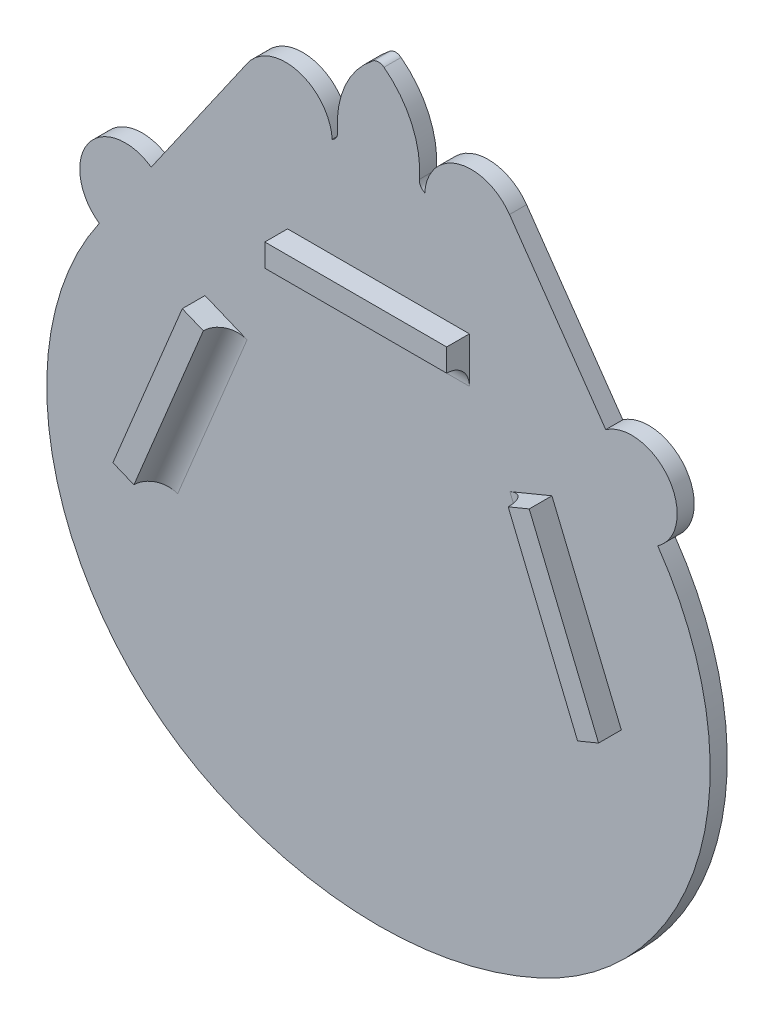
ISO-10303-21;
HEADER;
FILE_DESCRIPTION(('STEP AP214'),'2;1');
FILE_NAME('part.step','',(''),(''),'','','');
FILE_SCHEMA(('AUTOMOTIVE_DESIGN { 1 0 10303 214 1 1 1 1 }'));
ENDSEC;
DATA;
#1=APPLICATION_CONTEXT('core data for automotive mechanical design processes');
#2=APPLICATION_PROTOCOL_DEFINITION('international standard','automotive_design',2000,#1);
#3=PRODUCT_CONTEXT('',#1,'mechanical');
#4=PRODUCT('Part','Part','',(#3));
#5=PRODUCT_RELATED_PRODUCT_CATEGORY('part','',(#4));
#6=PRODUCT_DEFINITION_FORMATION('','',#4);
#7=PRODUCT_DEFINITION_CONTEXT('part definition',#1,'design');
#8=PRODUCT_DEFINITION('design','',#6,#7);
#9=PRODUCT_DEFINITION_SHAPE('','',#8);
#10=(LENGTH_UNIT() NAMED_UNIT(*) SI_UNIT(.MILLI.,.METRE.));
#11=(NAMED_UNIT(*) PLANE_ANGLE_UNIT() SI_UNIT($,.RADIAN.));
#12=(NAMED_UNIT(*) SI_UNIT($,.STERADIAN.) SOLID_ANGLE_UNIT());
#13=UNCERTAINTY_MEASURE_WITH_UNIT(LENGTH_MEASURE(1.E-05),#10,'distance_accuracy_value','');
#14=(GEOMETRIC_REPRESENTATION_CONTEXT(3) GLOBAL_UNCERTAINTY_ASSIGNED_CONTEXT((#13)) GLOBAL_UNIT_ASSIGNED_CONTEXT((#10,
#11,#12)) REPRESENTATION_CONTEXT('',''));
#15=CARTESIAN_POINT('',(0.,0.,0.));
#16=DIRECTION('',(0.,0.,1.));
#17=DIRECTION('',(1.,0.,0.));
#18=AXIS2_PLACEMENT_3D('',#15,#16,#17);
#19=CARTESIAN_POINT('',(-13.8853702908805,188.281326043095,4.7625));
#20=DIRECTION('',(0.,0.,1.));
#21=DIRECTION('',(1.,0.,0.));
#22=AXIS2_PLACEMENT_3D('',#19,#20,#21);
#23=PLANE('',#22);
#24=CARTESIAN_POINT('',(-13.8853702908805,188.281326043095,4.7625));
#25=DIRECTION('',(0.,0.,1.));
#26=DIRECTION('',(1.,0.,0.));
#27=AXIS2_PLACEMENT_3D('',#24,#25,#26);
#28=CIRCLE('',#27,25.4);
#29=CARTESIAN_POINT('',(11.436803074374,186.294485319737,4.7625));
#30=VERTEX_POINT('',#29);
#31=CARTESIAN_POINT('',(1.54281892120893,208.458812943994,4.7625));
#32=VERTEX_POINT('',#31);
#33=EDGE_CURVE('E284',#30,#32,#28,.T.);
#34=ORIENTED_EDGE('',*,*,#33,.T.);
#35=CARTESIAN_POINT('',(0.,206.441064253904,4.7625));
#36=DIRECTION('',(0.,0.,1.));
#37=DIRECTION('',(1.,0.,0.));
#38=AXIS2_PLACEMENT_3D('',#35,#36,#37);
#39=CIRCLE('',#38,2.54);
#40=CARTESIAN_POINT('',(-1.54281892120893,208.458812943994,4.7625));
#41=VERTEX_POINT('',#40);
#42=EDGE_CURVE('E379',#32,#41,#39,.T.);
#43=ORIENTED_EDGE('',*,*,#42,.T.);
#44=CARTESIAN_POINT('',(13.8853702908805,188.281326043095,4.7625));
#45=DIRECTION('',(0.,0.,-1.));
#46=DIRECTION('',(-1.,0.,0.));
#47=AXIS2_PLACEMENT_3D('',#44,#45,#46);
#48=CIRCLE('',#47,25.4);
#49=CARTESIAN_POINT('',(-11.436803074374,186.294485319737,4.7625));
#50=VERTEX_POINT('',#49);
#51=EDGE_CURVE('E287',#50,#41,#48,.T.);
#52=ORIENTED_EDGE('',*,*,#51,.F.);
#53=CARTESIAN_POINT('',(-13.9690204108995,186.095801247401,4.7625));
#54=DIRECTION('',(0.,0.,1.));
#55=DIRECTION('',(1.,0.,0.));
#56=AXIS2_PLACEMENT_3D('',#53,#54,#55);
#57=CIRCLE('',#56,2.54);
#58=CARTESIAN_POINT('',(-12.9267506258527,183.779495202169,4.7625));
#59=VERTEX_POINT('',#58);
#60=EDGE_CURVE('E387',#50,#59,#57,.F.);
#61=ORIENTED_EDGE('',*,*,#60,.T.);
#62=CARTESIAN_POINT('',(-25.9256059059936,182.927947731056,4.7625));
#63=DIRECTION('',(0.,0.,-1.));
#64=DIRECTION('',(-1.,0.,0.));
#65=AXIS2_PLACEMENT_3D('',#62,#63,#64);
#66=CIRCLE('',#65,13.0267176099586);
#67=CARTESIAN_POINT('',(-36.6160052473032,190.371786365318,4.7625));
#68=VERTEX_POINT('',#67);
#69=EDGE_CURVE('E291',#68,#59,#66,.T.);
#70=ORIENTED_EDGE('',*,*,#69,.F.);
#71=DIRECTION('',(0.571428571428567,0.820651806648293,0.));
#72=VECTOR('',#71,1.);
#73=CARTESIAN_POINT('',(-38.1,188.240561159318,4.7625));
#74=LINE('',#73,#72);
#75=CARTESIAN_POINT('',(-63.5,151.762588353802,4.7625));
#76=VERTEX_POINT('',#75);
#77=EDGE_CURVE('E294',#76,#68,#74,.T.);
#78=ORIENTED_EDGE('',*,*,#77,.F.);
#79=CARTESIAN_POINT('',(-70.7571428571429,141.340310409368,4.7625));
#80=DIRECTION('',(0.,0.,-1.));
#81=DIRECTION('',(-1.,0.,0.));
#82=AXIS2_PLACEMENT_3D('',#79,#80,#81);
#83=CIRCLE('',#82,12.7);
#84=CARTESIAN_POINT('',(-78.0142857142857,130.918032464935,4.7625));
#85=VERTEX_POINT('',#84);
#86=EDGE_CURVE('E297',#85,#76,#83,.T.);
#87=ORIENTED_EDGE('',*,*,#86,.F.);
#88=CARTESIAN_POINT('',(-10.8836666689395,84.1742692398599,4.7625));
#89=DIRECTION('',(0.,0.,-1.));
#90=DIRECTION('',(-1.,0.,0.));
#91=AXIS2_PLACEMENT_3D('',#88,#89,#90);
#92=CIRCLE('',#91,81.8015856438817);
#93=CARTESIAN_POINT('',(-44.9316658712465,9.795285889904,4.7625));
#94=VERTEX_POINT('',#93);
#95=EDGE_CURVE('E300',#94,#85,#92,.T.);
#96=ORIENTED_EDGE('',*,*,#95,.F.);
#97=CARTESIAN_POINT('',(0.,107.95,4.7625));
#98=DIRECTION('',(0.,0.,1.));
#99=DIRECTION('',(1.,0.,0.));
#100=AXIS2_PLACEMENT_3D('',#97,#98,#99);
#101=CIRCLE('',#100,107.95);
#102=CARTESIAN_POINT('',(44.9316658712466,9.79528588990389,4.7625));
#103=VERTEX_POINT('',#102);
#104=EDGE_CURVE('E303',#94,#103,#101,.T.);
#105=ORIENTED_EDGE('',*,*,#104,.T.);
#106=CARTESIAN_POINT('',(10.8836666689395,84.1742692398599,4.7625));
#107=DIRECTION('',(0.,0.,1.));
#108=DIRECTION('',(1.,0.,0.));
#109=AXIS2_PLACEMENT_3D('',#106,#107,#108);
#110=CIRCLE('',#109,81.8015856438817);
#111=CARTESIAN_POINT('',(78.0142857142859,130.918032464935,4.7625));
#112=VERTEX_POINT('',#111);
#113=EDGE_CURVE('E305',#103,#112,#110,.T.);
#114=ORIENTED_EDGE('',*,*,#113,.T.);
#115=CARTESIAN_POINT('',(70.7571428571429,141.340310409368,4.7625));
#116=DIRECTION('',(0.,0.,1.));
#117=DIRECTION('',(1.,0.,0.));
#118=AXIS2_PLACEMENT_3D('',#115,#116,#117);
#119=CIRCLE('',#118,12.7);
#120=CARTESIAN_POINT('',(63.5,151.762588353802,4.7625));
#121=VERTEX_POINT('',#120);
#122=EDGE_CURVE('E307',#112,#121,#119,.T.);
#123=ORIENTED_EDGE('',*,*,#122,.T.);
#124=DIRECTION('',(-0.571428571428572,0.82065180664829,0.));
#125=VECTOR('',#124,1.);
#126=CARTESIAN_POINT('',(63.5,151.762588353802,4.7625));
#127=LINE('',#126,#125);
#128=CARTESIAN_POINT('',(36.6160052473032,190.371786365318,4.7625));
#129=VERTEX_POINT('',#128);
#130=EDGE_CURVE('E309',#121,#129,#127,.T.);
#131=ORIENTED_EDGE('',*,*,#130,.T.);
#132=CARTESIAN_POINT('',(25.9256059059936,182.927947731056,4.7625));
#133=DIRECTION('',(0.,0.,1.));
#134=DIRECTION('',(1.,0.,0.));
#135=AXIS2_PLACEMENT_3D('',#132,#133,#134);
#136=CIRCLE('',#135,13.0267176099586);
#137=CARTESIAN_POINT('',(12.9267506258527,183.779495202169,4.7625));
#138=VERTEX_POINT('',#137);
#139=EDGE_CURVE('E311',#129,#138,#136,.T.);
#140=ORIENTED_EDGE('',*,*,#139,.T.);
#141=CARTESIAN_POINT('',(13.9690204108995,186.095801247401,4.7625));
#142=DIRECTION('',(0.,0.,1.));
#143=DIRECTION('',(1.,0.,0.));
#144=AXIS2_PLACEMENT_3D('',#141,#142,#143);
#145=CIRCLE('',#144,2.54);
#146=EDGE_CURVE('E383',#138,#30,#145,.F.);
#147=ORIENTED_EDGE('',*,*,#146,.T.);
#148=EDGE_LOOP('',(#34,#43,#52,#61,#70,#78,#87,#96,#105,#114,#123,#131,#140,#147));
#149=FACE_BOUND('',#148,.T.);
#150=DIRECTION('',(0.,1.,0.));
#151=VECTOR('',#150,1.);
#152=CARTESIAN_POINT('',(25.4,155.8925,4.7625));
#153=LINE('',#152,#151);
#154=CARTESIAN_POINT('',(25.4,143.1925,4.7625));
#155=VERTEX_POINT('',#154);
#156=CARTESIAN_POINT('',(25.4,155.8925,4.7625));
#157=VERTEX_POINT('',#156);
#158=EDGE_CURVE('E47',#155,#157,#153,.T.);
#159=ORIENTED_EDGE('',*,*,#158,.F.);
#160=DIRECTION('',(1.,0.,0.));
#161=VECTOR('',#160,1.);
#162=CARTESIAN_POINT('',(-13.8853702908805,143.1925,4.7625));
#163=LINE('',#162,#161);
#164=CARTESIAN_POINT('',(-25.4,143.1925,4.7625));
#165=VERTEX_POINT('',#164);
#166=EDGE_CURVE('E393',#155,#165,#163,.F.);
#167=ORIENTED_EDGE('',*,*,#166,.T.);
#168=DIRECTION('',(0.,-1.,0.));
#169=VECTOR('',#168,1.);
#170=CARTESIAN_POINT('',(-25.4,155.8925,4.7625));
#171=LINE('',#170,#169);
#172=CARTESIAN_POINT('',(-25.4,155.8925,4.7625));
#173=VERTEX_POINT('',#172);
#174=EDGE_CURVE('E55',#173,#165,#171,.T.);
#175=ORIENTED_EDGE('',*,*,#174,.F.);
#176=DIRECTION('',(-1.,0.,0.));
#177=VECTOR('',#176,1.);
#178=CARTESIAN_POINT('',(-25.4,155.8925,4.7625));
#179=LINE('',#178,#177);
#180=EDGE_CURVE('E269',#157,#173,#179,.T.);
#181=ORIENTED_EDGE('',*,*,#180,.F.);
#182=EDGE_LOOP('',(#159,#167,#175,#181));
#183=FACE_BOUND('',#182,.T.);
#184=DIRECTION('',(-0.924320621697091,0.38161680820622,0.));
#185=VECTOR('',#184,1.);
#186=CARTESIAN_POINT('',(-42.5894311769899,125.806411319782,4.7625));
#187=LINE('',#186,#185);
#188=CARTESIAN_POINT('',(-36.7199952292133,123.383144587672,4.7625));
#189=VERTEX_POINT('',#188);
#190=CARTESIAN_POINT('',(-48.4588671247664,128.229678051891,4.7625));
#191=VERTEX_POINT('',#190);
#192=EDGE_CURVE('E242',#189,#191,#187,.T.);
#193=ORIENTED_EDGE('',*,*,#192,.F.);
#194=DIRECTION('',(0.381616808206219,0.924320621697092,0.));
#195=VECTOR('',#194,1.);
#196=CARTESIAN_POINT('',(-10.5026136414785,186.884714558745,4.7625));
#197=LINE('',#196,#195);
#198=CARTESIAN_POINT('',(-56.1061290860893,76.4276570054598,4.7625));
#199=VERTEX_POINT('',#198);
#200=EDGE_CURVE('E390',#189,#199,#197,.F.);
#201=ORIENTED_EDGE('',*,*,#200,.T.);
#202=DIRECTION('',(0.924320621697091,-0.381616808206221,0.));
#203=VECTOR('',#202,1.);
#204=CARTESIAN_POINT('',(-67.8450009816423,81.2741904696788,4.7625));
#205=LINE('',#204,#203);
#206=CARTESIAN_POINT('',(-67.8450009816423,81.2741904696788,4.7625));
#207=VERTEX_POINT('',#206);
#208=EDGE_CURVE('E247',#207,#199,#205,.T.);
#209=ORIENTED_EDGE('',*,*,#208,.F.);
#210=DIRECTION('',(-0.38161680820622,-0.924320621697091,0.));
#211=VECTOR('',#210,1.);
#212=CARTESIAN_POINT('',(-48.4588671247664,128.229678051891,4.7625));
#213=LINE('',#212,#211);
#214=EDGE_CURVE('E258',#191,#207,#213,.T.);
#215=ORIENTED_EDGE('',*,*,#214,.F.);
#216=EDGE_LOOP('',(#193,#201,#209,#215));
#217=FACE_BOUND('',#216,.T.);
#218=DIRECTION('',(0.924320621697091,0.381616808206221,0.));
#219=VECTOR('',#218,1.);
#220=CARTESIAN_POINT('',(67.8450009816423,81.2741904696788,4.7625));
#221=LINE('',#220,#219);
#222=CARTESIAN_POINT('',(56.1061290860893,76.4276570054598,4.7625));
#223=VERTEX_POINT('',#222);
#224=CARTESIAN_POINT('',(67.8450009816423,81.2741904696788,4.7625));
#225=VERTEX_POINT('',#224);
#226=EDGE_CURVE('E236',#223,#225,#221,.T.);
#227=ORIENTED_EDGE('',*,*,#226,.F.);
#228=DIRECTION('',(0.381616808206219,-0.924320621697092,0.));
#229=VECTOR('',#228,1.);
#230=CARTESIAN_POINT('',(6.45832213628469,196.680462434675,4.7625));
#231=LINE('',#230,#229);
#232=CARTESIAN_POINT('',(36.7199952292133,123.383144587672,4.7625));
#233=VERTEX_POINT('',#232);
#234=EDGE_CURVE('E212',#223,#233,#231,.F.);
#235=ORIENTED_EDGE('',*,*,#234,.T.);
#236=DIRECTION('',(-0.924320621697091,-0.38161680820622,0.));
#237=VECTOR('',#236,1.);
#238=CARTESIAN_POINT('',(42.5894311769899,125.806411319782,4.7625));
#239=LINE('',#238,#237);
#240=CARTESIAN_POINT('',(48.4588671247664,128.229678051891,4.7625));
#241=VERTEX_POINT('',#240);
#242=EDGE_CURVE('E228',#241,#233,#239,.T.);
#243=ORIENTED_EDGE('',*,*,#242,.F.);
#244=DIRECTION('',(-0.38161680820622,0.924320621697091,0.));
#245=VECTOR('',#244,1.);
#246=CARTESIAN_POINT('',(48.4588671247664,128.229678051891,4.7625));
#247=LINE('',#246,#245);
#248=EDGE_CURVE('E230',#225,#241,#247,.T.);
#249=ORIENTED_EDGE('',*,*,#248,.F.);
#250=EDGE_LOOP('',(#227,#235,#243,#249));
#251=FACE_BOUND('',#250,.T.);
#252=ADVANCED_FACE('F32',(#149,#183,#217,#251),#23,.T.);
#253=CARTESIAN_POINT('',(-13.8853702908805,188.281326043095,4.7625));
#254=DIRECTION('',(0.,0.,-1.));
#255=DIRECTION('',(-1.,0.,0.));
#256=AXIS2_PLACEMENT_3D('',#253,#254,#255);
#257=CYLINDRICAL_SURFACE('',#256,25.4);
#258=ORIENTED_EDGE('',*,*,#33,.F.);
#259=DIRECTION('',(0.,0.,-1.));
#260=VECTOR('',#259,1.);
#261=CARTESIAN_POINT('',(11.436803074374,186.294485319737,4.7625));
#262=LINE('',#261,#260);
#263=CARTESIAN_POINT('',(11.436803074374,186.294485319737,0.));
#264=VERTEX_POINT('',#263);
#265=EDGE_CURVE('E369',#30,#264,#262,.T.);
#266=ORIENTED_EDGE('',*,*,#265,.T.);
#267=CARTESIAN_POINT('',(-13.8853702908805,188.281326043095,0.));
#268=DIRECTION('',(0.,0.,1.));
#269=DIRECTION('',(1.,0.,0.));
#270=AXIS2_PLACEMENT_3D('',#267,#268,#269);
#271=CIRCLE('',#270,25.4);
#272=CARTESIAN_POINT('',(1.54281892120893,208.458812943994,0.));
#273=VERTEX_POINT('',#272);
#274=EDGE_CURVE('E283',#264,#273,#271,.T.);
#275=ORIENTED_EDGE('',*,*,#274,.T.);
#276=DIRECTION('',(0.,0.,-1.));
#277=VECTOR('',#276,1.);
#278=CARTESIAN_POINT('',(1.54281892120894,208.458812943994,4.7625));
#279=LINE('',#278,#277);
#280=EDGE_CURVE('E367',#273,#32,#279,.F.);
#281=ORIENTED_EDGE('',*,*,#280,.T.);
#282=EDGE_LOOP('',(#258,#266,#275,#281));
#283=FACE_BOUND('',#282,.T.);
#284=ADVANCED_FACE('F424',(#283),#257,.T.);
#285=CARTESIAN_POINT('',(13.8853702908805,188.281326043095,4.7625));
#286=DIRECTION('',(0.,0.,-1.));
#287=DIRECTION('',(-1.,0.,0.));
#288=AXIS2_PLACEMENT_3D('',#285,#286,#287);
#289=CYLINDRICAL_SURFACE('',#288,25.4);
#290=CARTESIAN_POINT('',(13.8853702908805,188.281326043095,0.));
#291=DIRECTION('',(0.,0.,-1.));
#292=DIRECTION('',(-1.,0.,0.));
#293=AXIS2_PLACEMENT_3D('',#290,#291,#292);
#294=CIRCLE('',#293,25.4);
#295=CARTESIAN_POINT('',(-11.436803074374,186.294485319737,0.));
#296=VERTEX_POINT('',#295);
#297=CARTESIAN_POINT('',(-1.54281892120893,208.458812943994,0.));
#298=VERTEX_POINT('',#297);
#299=EDGE_CURVE('E316',#296,#298,#294,.T.);
#300=ORIENTED_EDGE('',*,*,#299,.F.);
#301=DIRECTION('',(0.,0.,-1.));
#302=VECTOR('',#301,1.);
#303=CARTESIAN_POINT('',(-11.436803074374,186.294485319737,4.7625));
#304=LINE('',#303,#302);
#305=EDGE_CURVE('E375',#296,#50,#304,.F.);
#306=ORIENTED_EDGE('',*,*,#305,.T.);
#307=ORIENTED_EDGE('',*,*,#51,.T.);
#308=DIRECTION('',(0.,0.,-1.));
#309=VECTOR('',#308,1.);
#310=CARTESIAN_POINT('',(-1.54281892120894,208.458812943994,4.7625));
#311=LINE('',#310,#309);
#312=EDGE_CURVE('E372',#41,#298,#311,.T.);
#313=ORIENTED_EDGE('',*,*,#312,.T.);
#314=EDGE_LOOP('',(#300,#306,#307,#313));
#315=FACE_BOUND('',#314,.T.);
#316=ADVANCED_FACE('F510',(#315),#289,.T.);
#317=CARTESIAN_POINT('',(-25.9256059059936,182.927947731056,4.7625));
#318=DIRECTION('',(0.,0.,-1.));
#319=DIRECTION('',(-1.,0.,0.));
#320=AXIS2_PLACEMENT_3D('',#317,#318,#319);
#321=CYLINDRICAL_SURFACE('',#320,13.0267176099586);
#322=CARTESIAN_POINT('',(-25.9256059059936,182.927947731056,0.));
#323=DIRECTION('',(0.,0.,-1.));
#324=DIRECTION('',(-1.,0.,0.));
#325=AXIS2_PLACEMENT_3D('',#322,#323,#324);
#326=CIRCLE('',#325,13.0267176099586);
#327=CARTESIAN_POINT('',(-36.6160052473032,190.371786365318,0.));
#328=VERTEX_POINT('',#327);
#329=CARTESIAN_POINT('',(-12.9267506258527,183.779495202169,0.));
#330=VERTEX_POINT('',#329);
#331=EDGE_CURVE('E319',#328,#330,#326,.T.);
#332=ORIENTED_EDGE('',*,*,#331,.F.);
#333=DIRECTION('',(0.,0.,-1.));
#334=VECTOR('',#333,1.);
#335=CARTESIAN_POINT('',(-36.6160052473032,190.371786365318,4.7625));
#336=LINE('',#335,#334);
#337=EDGE_CURVE('E361',#68,#328,#336,.T.);
#338=ORIENTED_EDGE('',*,*,#337,.F.);
#339=ORIENTED_EDGE('',*,*,#69,.T.);
#340=DIRECTION('',(0.,0.,-1.));
#341=VECTOR('',#340,1.);
#342=CARTESIAN_POINT('',(-12.9267506258527,183.779495202169,4.7625));
#343=LINE('',#342,#341);
#344=EDGE_CURVE('E364',#59,#330,#343,.T.);
#345=ORIENTED_EDGE('',*,*,#344,.T.);
#346=EDGE_LOOP('',(#332,#338,#339,#345));
#347=FACE_BOUND('',#346,.T.);
#348=ADVANCED_FACE('F506',(#347),#321,.T.);
#349=CARTESIAN_POINT('',(-63.5,151.762588353802,4.7625));
#350=DIRECTION('',(-0.82065180664829,0.571428571428571,0.));
#351=DIRECTION('',(-0.571428571428571,-0.82065180664829,0.));
#352=AXIS2_PLACEMENT_3D('',#349,#350,#351);
#353=PLANE('',#352);
#354=DIRECTION('',(0.571428571428571,0.82065180664829,0.));
#355=VECTOR('',#354,1.);
#356=CARTESIAN_POINT('',(-63.5,151.762588353802,0.));
#357=LINE('',#356,#355);
#358=CARTESIAN_POINT('',(-63.5,151.762588353802,0.));
#359=VERTEX_POINT('',#358);
#360=EDGE_CURVE('E322',#359,#328,#357,.T.);
#361=ORIENTED_EDGE('',*,*,#360,.F.);
#362=DIRECTION('',(0.,0.,-1.));
#363=VECTOR('',#362,1.);
#364=CARTESIAN_POINT('',(-63.5,151.762588353802,4.7625));
#365=LINE('',#364,#363);
#366=EDGE_CURVE('E359',#76,#359,#365,.T.);
#367=ORIENTED_EDGE('',*,*,#366,.F.);
#368=ORIENTED_EDGE('',*,*,#77,.T.);
#369=ORIENTED_EDGE('',*,*,#337,.T.);
#370=EDGE_LOOP('',(#361,#367,#368,#369));
#371=FACE_BOUND('',#370,.T.);
#372=ADVANCED_FACE('F502',(#371),#353,.T.);
#373=CARTESIAN_POINT('',(-70.7571428571429,141.340310409368,4.7625));
#374=DIRECTION('',(0.,0.,-1.));
#375=DIRECTION('',(-1.,0.,0.));
#376=AXIS2_PLACEMENT_3D('',#373,#374,#375);
#377=CYLINDRICAL_SURFACE('',#376,12.7);
#378=CARTESIAN_POINT('',(-70.7571428571429,141.340310409368,0.));
#379=DIRECTION('',(0.,0.,-1.));
#380=DIRECTION('',(-1.,0.,0.));
#381=AXIS2_PLACEMENT_3D('',#378,#379,#380);
#382=CIRCLE('',#381,12.7);
#383=CARTESIAN_POINT('',(-78.0142857142857,130.918032464935,0.));
#384=VERTEX_POINT('',#383);
#385=EDGE_CURVE('E324',#384,#359,#382,.T.);
#386=ORIENTED_EDGE('',*,*,#385,.F.);
#387=DIRECTION('',(0.,0.,-1.));
#388=VECTOR('',#387,1.);
#389=CARTESIAN_POINT('',(-78.0142857142857,130.918032464935,4.7625));
#390=LINE('',#389,#388);
#391=EDGE_CURVE('E357',#85,#384,#390,.T.);
#392=ORIENTED_EDGE('',*,*,#391,.F.);
#393=ORIENTED_EDGE('',*,*,#86,.T.);
#394=ORIENTED_EDGE('',*,*,#366,.T.);
#395=EDGE_LOOP('',(#386,#392,#393,#394));
#396=FACE_BOUND('',#395,.T.);
#397=ADVANCED_FACE('F498',(#396),#377,.T.);
#398=CARTESIAN_POINT('',(-10.8836666689395,84.1742692398599,4.7625));
#399=DIRECTION('',(0.,0.,-1.));
#400=DIRECTION('',(-1.,0.,0.));
#401=AXIS2_PLACEMENT_3D('',#398,#399,#400);
#402=CYLINDRICAL_SURFACE('',#401,81.8015856438817);
#403=CARTESIAN_POINT('',(-10.8836666689395,84.1742692398599,0.));
#404=DIRECTION('',(0.,0.,-1.));
#405=DIRECTION('',(-1.,0.,0.));
#406=AXIS2_PLACEMENT_3D('',#403,#404,#405);
#407=CIRCLE('',#406,81.8015856438817);
#408=CARTESIAN_POINT('',(-44.9316658712465,9.795285889904,0.));
#409=VERTEX_POINT('',#408);
#410=EDGE_CURVE('E327',#409,#384,#407,.T.);
#411=ORIENTED_EDGE('',*,*,#410,.F.);
#412=DIRECTION('',(0.,0.,-1.));
#413=VECTOR('',#412,1.);
#414=CARTESIAN_POINT('',(-44.9316658712465,9.795285889904,4.7625));
#415=LINE('',#414,#413);
#416=EDGE_CURVE('E355',#94,#409,#415,.T.);
#417=ORIENTED_EDGE('',*,*,#416,.F.);
#418=ORIENTED_EDGE('',*,*,#95,.T.);
#419=ORIENTED_EDGE('',*,*,#391,.T.);
#420=EDGE_LOOP('',(#411,#417,#418,#419));
#421=FACE_BOUND('',#420,.T.);
#422=ADVANCED_FACE('F494',(#421),#402,.T.);
#423=CARTESIAN_POINT('',(0.,107.95,4.7625));
#424=DIRECTION('',(0.,0.,-1.));
#425=DIRECTION('',(-1.,0.,0.));
#426=AXIS2_PLACEMENT_3D('',#423,#424,#425);
#427=CYLINDRICAL_SURFACE('',#426,107.95);
#428=CARTESIAN_POINT('',(0.,107.95,0.));
#429=DIRECTION('',(0.,0.,1.));
#430=DIRECTION('',(1.,0.,0.));
#431=AXIS2_PLACEMENT_3D('',#428,#429,#430);
#432=CIRCLE('',#431,107.95);
#433=CARTESIAN_POINT('',(44.9316658712466,9.79528588990389,0.));
#434=VERTEX_POINT('',#433);
#435=EDGE_CURVE('E330',#409,#434,#432,.T.);
#436=ORIENTED_EDGE('',*,*,#435,.T.);
#437=DIRECTION('',(0.,0.,-1.));
#438=VECTOR('',#437,1.);
#439=CARTESIAN_POINT('',(44.9316658712466,9.79528588990389,4.7625));
#440=LINE('',#439,#438);
#441=EDGE_CURVE('E352',#103,#434,#440,.T.);
#442=ORIENTED_EDGE('',*,*,#441,.F.);
#443=ORIENTED_EDGE('',*,*,#104,.F.);
#444=ORIENTED_EDGE('',*,*,#416,.T.);
#445=EDGE_LOOP('',(#436,#442,#443,#444));
#446=FACE_BOUND('',#445,.T.);
#447=ADVANCED_FACE('F490',(#446),#427,.T.);
#448=CARTESIAN_POINT('',(10.8836666689395,84.1742692398599,4.7625));
#449=DIRECTION('',(0.,0.,-1.));
#450=DIRECTION('',(-1.,0.,0.));
#451=AXIS2_PLACEMENT_3D('',#448,#449,#450);
#452=CYLINDRICAL_SURFACE('',#451,81.8015856438817);
#453=CARTESIAN_POINT('',(10.8836666689395,84.1742692398599,0.));
#454=DIRECTION('',(0.,0.,1.));
#455=DIRECTION('',(1.,0.,0.));
#456=AXIS2_PLACEMENT_3D('',#453,#454,#455);
#457=CIRCLE('',#456,81.8015856438817);
#458=CARTESIAN_POINT('',(78.0142857142859,130.918032464935,0.));
#459=VERTEX_POINT('',#458);
#460=EDGE_CURVE('E332',#434,#459,#457,.T.);
#461=ORIENTED_EDGE('',*,*,#460,.T.);
#462=DIRECTION('',(0.,0.,-1.));
#463=VECTOR('',#462,1.);
#464=CARTESIAN_POINT('',(78.0142857142859,130.918032464935,4.7625));
#465=LINE('',#464,#463);
#466=EDGE_CURVE('E349',#112,#459,#465,.T.);
#467=ORIENTED_EDGE('',*,*,#466,.F.);
#468=ORIENTED_EDGE('',*,*,#113,.F.);
#469=ORIENTED_EDGE('',*,*,#441,.T.);
#470=EDGE_LOOP('',(#461,#467,#468,#469));
#471=FACE_BOUND('',#470,.T.);
#472=ADVANCED_FACE('F486',(#471),#452,.T.);
#473=CARTESIAN_POINT('',(70.7571428571429,141.340310409368,4.7625));
#474=DIRECTION('',(0.,0.,-1.));
#475=DIRECTION('',(-1.,0.,0.));
#476=AXIS2_PLACEMENT_3D('',#473,#474,#475);
#477=CYLINDRICAL_SURFACE('',#476,12.7);
#478=CARTESIAN_POINT('',(70.7571428571429,141.340310409368,0.));
#479=DIRECTION('',(0.,0.,1.));
#480=DIRECTION('',(1.,0.,0.));
#481=AXIS2_PLACEMENT_3D('',#478,#479,#480);
#482=CIRCLE('',#481,12.7);
#483=CARTESIAN_POINT('',(63.5,151.762588353802,0.));
#484=VERTEX_POINT('',#483);
#485=EDGE_CURVE('E334',#459,#484,#482,.T.);
#486=ORIENTED_EDGE('',*,*,#485,.T.);
#487=DIRECTION('',(0.,0.,-1.));
#488=VECTOR('',#487,1.);
#489=CARTESIAN_POINT('',(63.5,151.762588353802,4.7625));
#490=LINE('',#489,#488);
#491=EDGE_CURVE('E346',#121,#484,#490,.T.);
#492=ORIENTED_EDGE('',*,*,#491,.F.);
#493=ORIENTED_EDGE('',*,*,#122,.F.);
#494=ORIENTED_EDGE('',*,*,#466,.T.);
#495=EDGE_LOOP('',(#486,#492,#493,#494));
#496=FACE_BOUND('',#495,.T.);
#497=ADVANCED_FACE('F482',(#496),#477,.T.);
#498=CARTESIAN_POINT('',(38.1,188.240561159318,4.7625));
#499=DIRECTION('',(-0.820651806648289,-0.571428571428573,0.));
#500=DIRECTION('',(0.571428571428573,-0.820651806648289,0.));
#501=AXIS2_PLACEMENT_3D('',#498,#499,#500);
#502=PLANE('',#501);
#503=DIRECTION('',(-0.571428571428573,0.820651806648289,0.));
#504=VECTOR('',#503,1.);
#505=CARTESIAN_POINT('',(38.1,188.240561159318,0.));
#506=LINE('',#505,#504);
#507=CARTESIAN_POINT('',(36.6160052473032,190.371786365318,0.));
#508=VERTEX_POINT('',#507);
#509=EDGE_CURVE('E337',#484,#508,#506,.T.);
#510=ORIENTED_EDGE('',*,*,#509,.T.);
#511=DIRECTION('',(0.,0.,-1.));
#512=VECTOR('',#511,1.);
#513=CARTESIAN_POINT('',(36.6160052473032,190.371786365318,4.7625));
#514=LINE('',#513,#512);
#515=EDGE_CURVE('E343',#129,#508,#514,.T.);
#516=ORIENTED_EDGE('',*,*,#515,.F.);
#517=ORIENTED_EDGE('',*,*,#130,.F.);
#518=ORIENTED_EDGE('',*,*,#491,.T.);
#519=EDGE_LOOP('',(#510,#516,#517,#518));
#520=FACE_BOUND('',#519,.T.);
#521=ADVANCED_FACE('F478',(#520),#502,.F.);
#522=CARTESIAN_POINT('',(25.9256059059936,182.927947731056,4.7625));
#523=DIRECTION('',(0.,0.,-1.));
#524=DIRECTION('',(-1.,0.,0.));
#525=AXIS2_PLACEMENT_3D('',#522,#523,#524);
#526=CYLINDRICAL_SURFACE('',#525,13.0267176099586);
#527=CARTESIAN_POINT('',(25.9256059059936,182.927947731056,0.));
#528=DIRECTION('',(0.,0.,1.));
#529=DIRECTION('',(1.,0.,0.));
#530=AXIS2_PLACEMENT_3D('',#527,#528,#529);
#531=CIRCLE('',#530,13.0267176099586);
#532=CARTESIAN_POINT('',(12.9267506258527,183.779495202169,0.));
#533=VERTEX_POINT('',#532);
#534=EDGE_CURVE('E288',#508,#533,#531,.T.);
#535=ORIENTED_EDGE('',*,*,#534,.T.);
#536=DIRECTION('',(0.,0.,-1.));
#537=VECTOR('',#536,1.);
#538=CARTESIAN_POINT('',(12.9267506258527,183.779495202169,4.7625));
#539=LINE('',#538,#537);
#540=EDGE_CURVE('E313',#138,#533,#539,.T.);
#541=ORIENTED_EDGE('',*,*,#540,.F.);
#542=ORIENTED_EDGE('',*,*,#139,.F.);
#543=ORIENTED_EDGE('',*,*,#515,.T.);
#544=EDGE_LOOP('',(#535,#541,#542,#543));
#545=FACE_BOUND('',#544,.T.);
#546=ADVANCED_FACE('F474',(#545),#526,.T.);
#547=CARTESIAN_POINT('',(-13.8853702908805,188.281326043095,0.));
#548=DIRECTION('',(0.,0.,1.));
#549=DIRECTION('',(1.,0.,0.));
#550=AXIS2_PLACEMENT_3D('',#547,#548,#549);
#551=PLANE('',#550);
#552=ORIENTED_EDGE('',*,*,#299,.T.);
#553=CARTESIAN_POINT('',(0.,206.441064253904,0.));
#554=DIRECTION('',(0.,0.,1.));
#555=DIRECTION('',(1.,0.,0.));
#556=AXIS2_PLACEMENT_3D('',#553,#554,#555);
#557=CIRCLE('',#556,2.54);
#558=EDGE_CURVE('E377',#298,#273,#557,.F.);
#559=ORIENTED_EDGE('',*,*,#558,.T.);
#560=ORIENTED_EDGE('',*,*,#274,.F.);
#561=CARTESIAN_POINT('',(13.9690204108995,186.095801247401,0.));
#562=DIRECTION('',(0.,0.,1.));
#563=DIRECTION('',(1.,0.,0.));
#564=AXIS2_PLACEMENT_3D('',#561,#562,#563);
#565=CIRCLE('',#564,2.54);
#566=EDGE_CURVE('E381',#264,#533,#565,.T.);
#567=ORIENTED_EDGE('',*,*,#566,.T.);
#568=ORIENTED_EDGE('',*,*,#534,.F.);
#569=ORIENTED_EDGE('',*,*,#509,.F.);
#570=ORIENTED_EDGE('',*,*,#485,.F.);
#571=ORIENTED_EDGE('',*,*,#460,.F.);
#572=ORIENTED_EDGE('',*,*,#435,.F.);
#573=ORIENTED_EDGE('',*,*,#410,.T.);
#574=ORIENTED_EDGE('',*,*,#385,.T.);
#575=ORIENTED_EDGE('',*,*,#360,.T.);
#576=ORIENTED_EDGE('',*,*,#331,.T.);
#577=CARTESIAN_POINT('',(-13.9690204108995,186.095801247401,0.));
#578=DIRECTION('',(0.,0.,1.));
#579=DIRECTION('',(1.,0.,0.));
#580=AXIS2_PLACEMENT_3D('',#577,#578,#579);
#581=CIRCLE('',#580,2.54);
#582=EDGE_CURVE('E385',#330,#296,#581,.T.);
#583=ORIENTED_EDGE('',*,*,#582,.T.);
#584=EDGE_LOOP('',(#552,#559,#560,#567,#568,#569,#570,#571,#572,#573,#574,#575,#576,#583));
#585=FACE_BOUND('',#584,.T.);
#586=ADVANCED_FACE('F470',(#585),#551,.F.);
#587=CARTESIAN_POINT('',(13.9690204108995,186.095801247401,4.7625));
#588=DIRECTION('',(0.,0.,1.));
#589=DIRECTION('',(1.,0.,0.));
#590=AXIS2_PLACEMENT_3D('',#587,#588,#589);
#591=CYLINDRICAL_SURFACE('',#590,2.54);
#592=ORIENTED_EDGE('',*,*,#146,.F.);
#593=ORIENTED_EDGE('',*,*,#540,.T.);
#594=ORIENTED_EDGE('',*,*,#566,.F.);
#595=ORIENTED_EDGE('',*,*,#265,.F.);
#596=EDGE_LOOP('',(#592,#593,#594,#595));
#597=FACE_BOUND('',#596,.T.);
#598=ADVANCED_FACE('F473',(#597),#591,.F.);
#599=CARTESIAN_POINT('',(-13.9690204108995,186.095801247401,4.7625));
#600=DIRECTION('',(0.,0.,1.));
#601=DIRECTION('',(1.,0.,0.));
#602=AXIS2_PLACEMENT_3D('',#599,#600,#601);
#603=CYLINDRICAL_SURFACE('',#602,2.54);
#604=ORIENTED_EDGE('',*,*,#60,.F.);
#605=ORIENTED_EDGE('',*,*,#305,.F.);
#606=ORIENTED_EDGE('',*,*,#582,.F.);
#607=ORIENTED_EDGE('',*,*,#344,.F.);
#608=EDGE_LOOP('',(#604,#605,#606,#607));
#609=FACE_BOUND('',#608,.T.);
#610=ADVANCED_FACE('F520',(#609),#603,.F.);
#611=CARTESIAN_POINT('',(0.,206.441064253904,4.7625));
#612=DIRECTION('',(0.,0.,-1.));
#613=DIRECTION('',(-1.,0.,0.));
#614=AXIS2_PLACEMENT_3D('',#611,#612,#613);
#615=CYLINDRICAL_SURFACE('',#614,2.54);
#616=ORIENTED_EDGE('',*,*,#42,.F.);
#617=ORIENTED_EDGE('',*,*,#280,.F.);
#618=ORIENTED_EDGE('',*,*,#558,.F.);
#619=ORIENTED_EDGE('',*,*,#312,.F.);
#620=EDGE_LOOP('',(#616,#617,#618,#619));
#621=FACE_BOUND('',#620,.T.);
#622=ADVANCED_FACE('F468',(#621),#615,.T.);
#623=CARTESIAN_POINT('',(-25.4,155.8925,11.1125));
#624=DIRECTION('',(1.,0.,0.));
#625=DIRECTION('',(0.,0.,-1.));
#626=AXIS2_PLACEMENT_3D('',#623,#624,#625);
#627=PLANE('',#626);
#628=ORIENTED_EDGE('',*,*,#174,.T.);
#629=CARTESIAN_POINT('',(-25.4,143.1925,11.1125));
#630=DIRECTION('',(1.,0.,0.));
#631=DIRECTION('',(0.,0.,-1.));
#632=AXIS2_PLACEMENT_3D('',#629,#630,#631);
#633=CIRCLE('',#632,6.35);
#634=CARTESIAN_POINT('',(-25.4,149.5425,11.1125));
#635=VERTEX_POINT('',#634);
#636=EDGE_CURVE('E397',#165,#635,#633,.T.);
#637=ORIENTED_EDGE('',*,*,#636,.T.);
#638=DIRECTION('',(0.,-1.,0.));
#639=VECTOR('',#638,1.);
#640=CARTESIAN_POINT('',(-25.4,155.8925,11.1125));
#641=LINE('',#640,#639);
#642=CARTESIAN_POINT('',(-25.4,155.8925,11.1125));
#643=VERTEX_POINT('',#642);
#644=EDGE_CURVE('E265',#643,#635,#641,.T.);
#645=ORIENTED_EDGE('',*,*,#644,.F.);
#646=DIRECTION('',(0.,0.,-1.));
#647=VECTOR('',#646,1.);
#648=CARTESIAN_POINT('',(-25.4,155.8925,11.1125));
#649=LINE('',#648,#647);
#650=EDGE_CURVE('E276',#643,#173,#649,.T.);
#651=ORIENTED_EDGE('',*,*,#650,.T.);
#652=EDGE_LOOP('',(#628,#637,#645,#651));
#653=FACE_BOUND('',#652,.T.);
#654=ADVANCED_FACE('F465',(#653),#627,.F.);
#655=CARTESIAN_POINT('',(25.4,155.8925,11.1125));
#656=DIRECTION('',(-1.,0.,0.));
#657=DIRECTION('',(0.,-1.,0.));
#658=AXIS2_PLACEMENT_3D('',#655,#656,#657);
#659=PLANE('',#658);
#660=ORIENTED_EDGE('',*,*,#158,.T.);
#661=DIRECTION('',(0.,0.,-1.));
#662=VECTOR('',#661,1.);
#663=CARTESIAN_POINT('',(25.4,155.8925,11.1125));
#664=LINE('',#663,#662);
#665=CARTESIAN_POINT('',(25.4,155.8925,11.1125));
#666=VERTEX_POINT('',#665);
#667=EDGE_CURVE('E281',#666,#157,#664,.T.);
#668=ORIENTED_EDGE('',*,*,#667,.F.);
#669=DIRECTION('',(0.,1.,0.));
#670=VECTOR('',#669,1.);
#671=CARTESIAN_POINT('',(25.4,155.8925,11.1125));
#672=LINE('',#671,#670);
#673=CARTESIAN_POINT('',(25.4,149.5425,11.1125));
#674=VERTEX_POINT('',#673);
#675=EDGE_CURVE('E272',#674,#666,#672,.T.);
#676=ORIENTED_EDGE('',*,*,#675,.F.);
#677=CARTESIAN_POINT('',(25.4,143.1925,11.1125));
#678=DIRECTION('',(-1.,0.,0.));
#679=DIRECTION('',(0.,-1.,0.));
#680=AXIS2_PLACEMENT_3D('',#677,#678,#679);
#681=CIRCLE('',#680,6.35);
#682=EDGE_CURVE('E395',#674,#155,#681,.T.);
#683=ORIENTED_EDGE('',*,*,#682,.T.);
#684=EDGE_LOOP('',(#660,#668,#676,#683));
#685=FACE_BOUND('',#684,.T.);
#686=ADVANCED_FACE('F461',(#685),#659,.F.);
#687=CARTESIAN_POINT('',(-25.4,155.8925,11.1125));
#688=DIRECTION('',(0.,-1.,0.));
#689=DIRECTION('',(1.,0.,0.));
#690=AXIS2_PLACEMENT_3D('',#687,#688,#689);
#691=PLANE('',#690);
#692=ORIENTED_EDGE('',*,*,#180,.T.);
#693=ORIENTED_EDGE('',*,*,#650,.F.);
#694=DIRECTION('',(-1.,0.,0.));
#695=VECTOR('',#694,1.);
#696=CARTESIAN_POINT('',(-25.4,155.8925,11.1125));
#697=LINE('',#696,#695);
#698=EDGE_CURVE('E274',#666,#643,#697,.T.);
#699=ORIENTED_EDGE('',*,*,#698,.F.);
#700=ORIENTED_EDGE('',*,*,#667,.T.);
#701=EDGE_LOOP('',(#692,#693,#699,#700));
#702=FACE_BOUND('',#701,.T.);
#703=ADVANCED_FACE('F457',(#702),#691,.F.);
#704=CARTESIAN_POINT('',(0.,0.,11.1125));
#705=DIRECTION('',(0.,0.,1.));
#706=DIRECTION('',(1.,0.,0.));
#707=AXIS2_PLACEMENT_3D('',#704,#705,#706);
#708=PLANE('',#707);
#709=ORIENTED_EDGE('',*,*,#644,.T.);
#710=DIRECTION('',(1.,0.,0.));
#711=VECTOR('',#710,1.);
#712=CARTESIAN_POINT('',(-25.4,149.5425,11.1125));
#713=LINE('',#712,#711);
#714=EDGE_CURVE('E268',#635,#674,#713,.T.);
#715=ORIENTED_EDGE('',*,*,#714,.T.);
#716=ORIENTED_EDGE('',*,*,#675,.T.);
#717=ORIENTED_EDGE('',*,*,#698,.T.);
#718=EDGE_LOOP('',(#709,#715,#716,#717));
#719=FACE_BOUND('',#718,.T.);
#720=ADVANCED_FACE('F454',(#719),#708,.T.);
#721=CARTESIAN_POINT('',(-42.5894311769899,125.806411319782,11.1125));
#722=DIRECTION('',(-0.38161680820622,-0.924320621697091,0.));
#723=DIRECTION('',(0.924320621697092,-0.38161680820622,0.));
#724=AXIS2_PLACEMENT_3D('',#721,#722,#723);
#725=PLANE('',#724);
#726=ORIENTED_EDGE('',*,*,#192,.T.);
#727=DIRECTION('',(0.,0.,-1.));
#728=VECTOR('',#727,1.);
#729=CARTESIAN_POINT('',(-48.4588671247664,128.229678051891,11.1125));
#730=LINE('',#729,#728);
#731=CARTESIAN_POINT('',(-48.4588671247664,128.229678051891,11.1125));
#732=VERTEX_POINT('',#731);
#733=EDGE_CURVE('E263',#732,#191,#730,.T.);
#734=ORIENTED_EDGE('',*,*,#733,.F.);
#735=DIRECTION('',(-0.924320621697091,0.38161680820622,0.));
#736=VECTOR('',#735,1.);
#737=CARTESIAN_POINT('',(-42.5894311769899,125.806411319782,11.1125));
#738=LINE('',#737,#736);
#739=CARTESIAN_POINT('',(-42.5894311769899,125.806411319782,11.1125));
#740=VERTEX_POINT('',#739);
#741=EDGE_CURVE('E243',#740,#732,#738,.T.);
#742=ORIENTED_EDGE('',*,*,#741,.F.);
#743=CARTESIAN_POINT('',(-36.7199952292133,123.383144587672,11.1125));
#744=DIRECTION('',(-0.38161680820622,-0.924320621697091,0.));
#745=DIRECTION('',(0.924320621697092,-0.38161680820622,0.));
#746=AXIS2_PLACEMENT_3D('',#743,#744,#745);
#747=CIRCLE('',#746,6.35);
#748=EDGE_CURVE('E399',#740,#189,#747,.T.);
#749=ORIENTED_EDGE('',*,*,#748,.T.);
#750=EDGE_LOOP('',(#726,#734,#742,#749));
#751=FACE_BOUND('',#750,.T.);
#752=ADVANCED_FACE('F416',(#751),#725,.F.);
#753=CARTESIAN_POINT('',(-48.4588671247664,128.229678051891,11.1125));
#754=DIRECTION('',(0.924320621697091,-0.38161680820622,0.));
#755=DIRECTION('',(0.38161680820622,0.924320621697092,0.));
#756=AXIS2_PLACEMENT_3D('',#753,#754,#755);
#757=PLANE('',#756);
#758=ORIENTED_EDGE('',*,*,#214,.T.);
#759=DIRECTION('',(0.,0.,-1.));
#760=VECTOR('',#759,1.);
#761=CARTESIAN_POINT('',(-67.8450009816423,81.2741904696788,11.1125));
#762=LINE('',#761,#760);
#763=CARTESIAN_POINT('',(-67.8450009816423,81.2741904696788,11.1125));
#764=VERTEX_POINT('',#763);
#765=EDGE_CURVE('E255',#764,#207,#762,.T.);
#766=ORIENTED_EDGE('',*,*,#765,.F.);
#767=DIRECTION('',(-0.38161680820622,-0.924320621697091,0.));
#768=VECTOR('',#767,1.);
#769=CARTESIAN_POINT('',(-48.4588671247664,128.229678051891,11.1125));
#770=LINE('',#769,#768);
#771=EDGE_CURVE('E246',#732,#764,#770,.T.);
#772=ORIENTED_EDGE('',*,*,#771,.F.);
#773=ORIENTED_EDGE('',*,*,#733,.T.);
#774=EDGE_LOOP('',(#758,#766,#772,#773));
#775=FACE_BOUND('',#774,.T.);
#776=ADVANCED_FACE('F420',(#775),#757,.F.);
#777=CARTESIAN_POINT('',(-67.8450009816423,81.2741904696788,11.1125));
#778=DIRECTION('',(0.381616808206221,0.924320621697091,0.));
#779=DIRECTION('',(-0.924320621697091,0.381616808206221,0.));
#780=AXIS2_PLACEMENT_3D('',#777,#778,#779);
#781=PLANE('',#780);
#782=ORIENTED_EDGE('',*,*,#208,.T.);
#783=CARTESIAN_POINT('',(-56.1061290860893,76.4276570054598,11.1125));
#784=DIRECTION('',(0.381616808206221,0.924320621697091,0.));
#785=DIRECTION('',(-0.924320621697091,0.381616808206221,0.));
#786=AXIS2_PLACEMENT_3D('',#783,#784,#785);
#787=CIRCLE('',#786,6.35);
#788=CARTESIAN_POINT('',(-61.9755650338658,78.8509237375693,11.1125));
#789=VERTEX_POINT('',#788);
#790=EDGE_CURVE('E214',#199,#789,#787,.T.);
#791=ORIENTED_EDGE('',*,*,#790,.T.);
#792=DIRECTION('',(0.924320621697091,-0.381616808206221,0.));
#793=VECTOR('',#792,1.);
#794=CARTESIAN_POINT('',(-67.8450009816423,81.2741904696788,11.1125));
#795=LINE('',#794,#793);
#796=EDGE_CURVE('E249',#764,#789,#795,.T.);
#797=ORIENTED_EDGE('',*,*,#796,.F.);
#798=ORIENTED_EDGE('',*,*,#765,.T.);
#799=EDGE_LOOP('',(#782,#791,#797,#798));
#800=FACE_BOUND('',#799,.T.);
#801=ADVANCED_FACE('F405',(#800),#781,.F.);
#802=CARTESIAN_POINT('',(0.,0.,11.1125));
#803=DIRECTION('',(0.,0.,1.));
#804=DIRECTION('',(1.,0.,0.));
#805=AXIS2_PLACEMENT_3D('',#802,#803,#804);
#806=PLANE('',#805);
#807=ORIENTED_EDGE('',*,*,#741,.T.);
#808=ORIENTED_EDGE('',*,*,#771,.T.);
#809=ORIENTED_EDGE('',*,*,#796,.T.);
#810=DIRECTION('',(0.381616808206219,0.924320621697091,0.));
#811=VECTOR('',#810,1.);
#812=CARTESIAN_POINT('',(-61.9755650338658,78.8509237375693,11.1125));
#813=LINE('',#812,#811);
#814=EDGE_CURVE('E252',#789,#740,#813,.T.);
#815=ORIENTED_EDGE('',*,*,#814,.T.);
#816=EDGE_LOOP('',(#807,#808,#809,#815));
#817=FACE_BOUND('',#816,.T.);
#818=ADVANCED_FACE('F411',(#817),#806,.T.);
#819=CARTESIAN_POINT('',(67.8450009816423,81.2741904696788,11.1125));
#820=DIRECTION('',(-0.381616808206221,0.924320621697091,0.));
#821=DIRECTION('',(-0.924320621697091,-0.381616808206221,0.));
#822=AXIS2_PLACEMENT_3D('',#819,#820,#821);
#823=PLANE('',#822);
#824=ORIENTED_EDGE('',*,*,#226,.T.);
#825=DIRECTION('',(0.,0.,-1.));
#826=VECTOR('',#825,1.);
#827=CARTESIAN_POINT('',(67.8450009816423,81.2741904696788,11.1125));
#828=LINE('',#827,#826);
#829=CARTESIAN_POINT('',(67.8450009816423,81.2741904696788,11.1125));
#830=VERTEX_POINT('',#829);
#831=EDGE_CURVE('E219',#830,#225,#828,.T.);
#832=ORIENTED_EDGE('',*,*,#831,.F.);
#833=DIRECTION('',(0.924320621697091,0.381616808206221,0.));
#834=VECTOR('',#833,1.);
#835=CARTESIAN_POINT('',(67.8450009816423,81.2741904696788,11.1125));
#836=LINE('',#835,#834);
#837=CARTESIAN_POINT('',(61.9755650338658,78.8509237375693,11.1125));
#838=VERTEX_POINT('',#837);
#839=EDGE_CURVE('E216',#838,#830,#836,.T.);
#840=ORIENTED_EDGE('',*,*,#839,.F.);
#841=CARTESIAN_POINT('',(56.1061290860893,76.4276570054598,11.1125));
#842=DIRECTION('',(-0.381616808206221,0.924320621697091,0.));
#843=DIRECTION('',(-0.924320621697091,-0.381616808206221,0.));
#844=AXIS2_PLACEMENT_3D('',#841,#842,#843);
#845=CIRCLE('',#844,6.35);
#846=EDGE_CURVE('E40',#838,#223,#845,.T.);
#847=ORIENTED_EDGE('',*,*,#846,.T.);
#848=EDGE_LOOP('',(#824,#832,#840,#847));
#849=FACE_BOUND('',#848,.T.);
#850=ADVANCED_FACE('F217',(#849),#823,.F.);
#851=CARTESIAN_POINT('',(48.4588671247664,128.229678051891,11.1125));
#852=DIRECTION('',(-0.924320621697091,-0.38161680820622,0.));
#853=DIRECTION('',(0.38161680820622,-0.924320621697092,0.));
#854=AXIS2_PLACEMENT_3D('',#851,#852,#853);
#855=PLANE('',#854);
#856=ORIENTED_EDGE('',*,*,#248,.T.);
#857=DIRECTION('',(0.,0.,-1.));
#858=VECTOR('',#857,1.);
#859=CARTESIAN_POINT('',(48.4588671247664,128.229678051891,11.1125));
#860=LINE('',#859,#858);
#861=CARTESIAN_POINT('',(48.4588671247664,128.229678051891,11.1125));
#862=VERTEX_POINT('',#861);
#863=EDGE_CURVE('E235',#862,#241,#860,.T.);
#864=ORIENTED_EDGE('',*,*,#863,.F.);
#865=DIRECTION('',(-0.38161680820622,0.924320621697091,0.));
#866=VECTOR('',#865,1.);
#867=CARTESIAN_POINT('',(48.4588671247664,128.229678051891,11.1125));
#868=LINE('',#867,#866);
#869=EDGE_CURVE('E222',#830,#862,#868,.T.);
#870=ORIENTED_EDGE('',*,*,#869,.F.);
#871=ORIENTED_EDGE('',*,*,#831,.T.);
#872=EDGE_LOOP('',(#856,#864,#870,#871));
#873=FACE_BOUND('',#872,.T.);
#874=ADVANCED_FACE('F430',(#873),#855,.F.);
#875=CARTESIAN_POINT('',(42.5894311769899,125.806411319782,11.1125));
#876=DIRECTION('',(0.38161680820622,-0.924320621697091,0.));
#877=DIRECTION('',(0.924320621697092,0.38161680820622,0.));
#878=AXIS2_PLACEMENT_3D('',#875,#876,#877);
#879=PLANE('',#878);
#880=ORIENTED_EDGE('',*,*,#242,.T.);
#881=CARTESIAN_POINT('',(36.7199952292133,123.383144587672,11.1125));
#882=DIRECTION('',(0.38161680820622,-0.924320621697091,0.));
#883=DIRECTION('',(0.924320621697092,0.38161680820622,0.));
#884=AXIS2_PLACEMENT_3D('',#881,#882,#883);
#885=CIRCLE('',#884,6.35);
#886=CARTESIAN_POINT('',(42.5894311769899,125.806411319782,11.1125));
#887=VERTEX_POINT('',#886);
#888=EDGE_CURVE('E11',#233,#887,#885,.T.);
#889=ORIENTED_EDGE('',*,*,#888,.T.);
#890=DIRECTION('',(-0.924320621697091,-0.38161680820622,0.));
#891=VECTOR('',#890,1.);
#892=CARTESIAN_POINT('',(42.5894311769899,125.806411319782,11.1125));
#893=LINE('',#892,#891);
#894=EDGE_CURVE('E227',#862,#887,#893,.T.);
#895=ORIENTED_EDGE('',*,*,#894,.F.);
#896=ORIENTED_EDGE('',*,*,#863,.T.);
#897=EDGE_LOOP('',(#880,#889,#895,#896));
#898=FACE_BOUND('',#897,.T.);
#899=ADVANCED_FACE('F433',(#898),#879,.F.);
#900=CARTESIAN_POINT('',(0.,0.,11.1125));
#901=DIRECTION('',(0.,0.,-1.));
#902=DIRECTION('',(-1.,0.,0.));
#903=AXIS2_PLACEMENT_3D('',#900,#901,#902);
#904=PLANE('',#903);
#905=DIRECTION('',(0.381616808206219,-0.924320621697091,0.));
#906=VECTOR('',#905,1.);
#907=CARTESIAN_POINT('',(61.9755650338658,78.8509237375693,11.1125));
#908=LINE('',#907,#906);
#909=EDGE_CURVE('E210',#887,#838,#908,.T.);
#910=ORIENTED_EDGE('',*,*,#909,.T.);
#911=ORIENTED_EDGE('',*,*,#839,.T.);
#912=ORIENTED_EDGE('',*,*,#869,.T.);
#913=ORIENTED_EDGE('',*,*,#894,.T.);
#914=EDGE_LOOP('',(#910,#911,#912,#913));
#915=FACE_BOUND('',#914,.T.);
#916=ADVANCED_FACE('F225',(#915),#904,.F.);
#917=CARTESIAN_POINT('',(-25.4,143.1925,11.1125));
#918=DIRECTION('',(1.,0.,0.));
#919=DIRECTION('',(0.,0.,-1.));
#920=AXIS2_PLACEMENT_3D('',#917,#918,#919);
#921=CYLINDRICAL_SURFACE('',#920,6.35);
#922=ORIENTED_EDGE('',*,*,#636,.F.);
#923=ORIENTED_EDGE('',*,*,#166,.F.);
#924=ORIENTED_EDGE('',*,*,#682,.F.);
#925=ORIENTED_EDGE('',*,*,#714,.F.);
#926=EDGE_LOOP('',(#922,#923,#924,#925));
#927=FACE_BOUND('',#926,.T.);
#928=ADVANCED_FACE('F440',(#927),#921,.F.);
#929=CARTESIAN_POINT('',(-56.1061290860893,76.4276570054598,11.1125));
#930=DIRECTION('',(0.381616808206219,0.924320621697092,0.));
#931=DIRECTION('',(-0.924320621697091,0.381616808206219,0.));
#932=AXIS2_PLACEMENT_3D('',#929,#930,#931);
#933=CYLINDRICAL_SURFACE('',#932,6.35);
#934=ORIENTED_EDGE('',*,*,#790,.F.);
#935=ORIENTED_EDGE('',*,*,#200,.F.);
#936=ORIENTED_EDGE('',*,*,#748,.F.);
#937=ORIENTED_EDGE('',*,*,#814,.F.);
#938=EDGE_LOOP('',(#934,#935,#936,#937));
#939=FACE_BOUND('',#938,.T.);
#940=ADVANCED_FACE('F414',(#939),#933,.F.);
#941=CARTESIAN_POINT('',(56.1061290860893,76.4276570054598,11.1125));
#942=DIRECTION('',(0.381616808206219,-0.924320621697092,0.));
#943=DIRECTION('',(0.924320621697091,0.381616808206219,0.));
#944=AXIS2_PLACEMENT_3D('',#941,#942,#943);
#945=CYLINDRICAL_SURFACE('',#944,6.35);
#946=ORIENTED_EDGE('',*,*,#888,.F.);
#947=ORIENTED_EDGE('',*,*,#234,.F.);
#948=ORIENTED_EDGE('',*,*,#846,.F.);
#949=ORIENTED_EDGE('',*,*,#909,.F.);
#950=EDGE_LOOP('',(#946,#947,#948,#949));
#951=FACE_BOUND('',#950,.T.);
#952=ADVANCED_FACE('F34',(#951),#945,.F.);
#953=CLOSED_SHELL('',(#252,#284,#316,#348,#372,#397,#422,#447,#472,#497,#521,#546,#586,#598,
#610,#622,#654,#686,#703,#720,#752,#776,#801,#818,#850,#874,#899,#916,#928,#940,#952));
#954=MANIFOLD_SOLID_BREP('B2',#953);
#955=ADVANCED_BREP_SHAPE_REPRESENTATION('',(#18,#954),#14);
#956=SHAPE_DEFINITION_REPRESENTATION(#9,#955);
ENDSEC;
END-ISO-10303-21;
